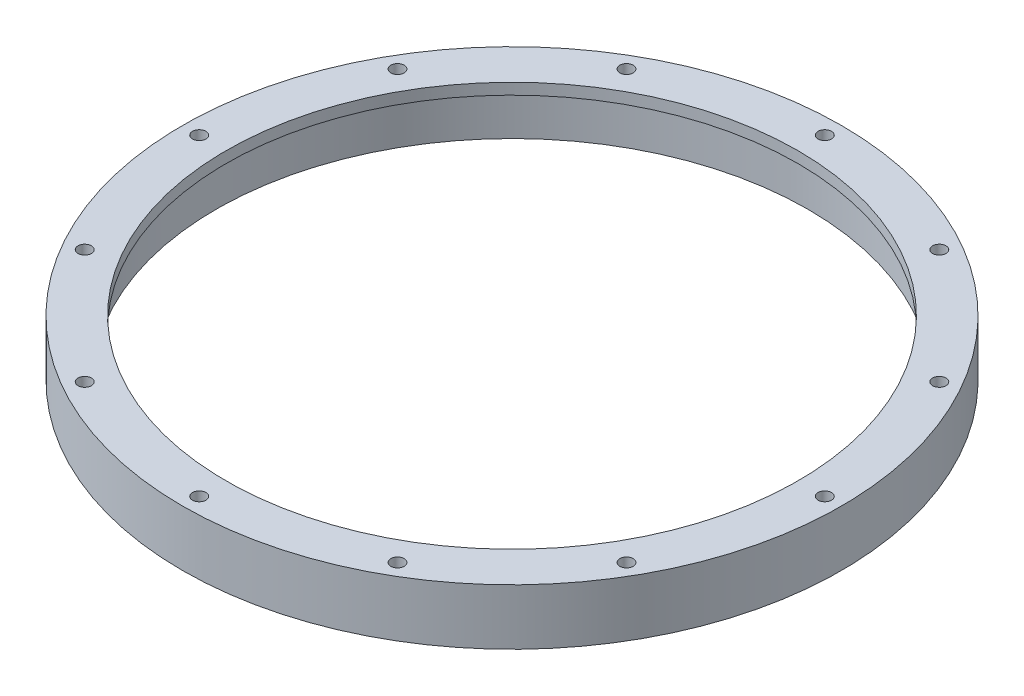
ISO-10303-21;
HEADER;
FILE_DESCRIPTION(('STEP AP214'),'2;1');
FILE_NAME('part.step','',(''),(''),'','','');
FILE_SCHEMA(('AUTOMOTIVE_DESIGN { 1 0 10303 214 1 1 1 1 }'));
ENDSEC;
DATA;
#1=APPLICATION_CONTEXT('core data for automotive mechanical design processes');
#2=APPLICATION_PROTOCOL_DEFINITION('international standard','automotive_design',2000,#1);
#3=PRODUCT_CONTEXT('',#1,'mechanical');
#4=PRODUCT('Part','Part','',(#3));
#5=PRODUCT_RELATED_PRODUCT_CATEGORY('part','',(#4));
#6=PRODUCT_DEFINITION_FORMATION('','',#4);
#7=PRODUCT_DEFINITION_CONTEXT('part definition',#1,'design');
#8=PRODUCT_DEFINITION('design','',#6,#7);
#9=PRODUCT_DEFINITION_SHAPE('','',#8);
#10=(LENGTH_UNIT() NAMED_UNIT(*) SI_UNIT(.MILLI.,.METRE.));
#11=(NAMED_UNIT(*) PLANE_ANGLE_UNIT() SI_UNIT($,.RADIAN.));
#12=(NAMED_UNIT(*) SI_UNIT($,.STERADIAN.) SOLID_ANGLE_UNIT());
#13=UNCERTAINTY_MEASURE_WITH_UNIT(LENGTH_MEASURE(1.E-05),#10,'distance_accuracy_value','');
#14=(GEOMETRIC_REPRESENTATION_CONTEXT(3) GLOBAL_UNCERTAINTY_ASSIGNED_CONTEXT((#13)) GLOBAL_UNIT_ASSIGNED_CONTEXT((#10,
#11,#12)) REPRESENTATION_CONTEXT('',''));
#15=CARTESIAN_POINT('',(0.,0.,0.));
#16=DIRECTION('',(0.,0.,1.));
#17=DIRECTION('',(1.,0.,0.));
#18=AXIS2_PLACEMENT_3D('',#15,#16,#17);
#19=CARTESIAN_POINT('',(0.,0.,0.));
#20=DIRECTION('',(0.,-1.,0.));
#21=DIRECTION('',(0.,0.,-1.));
#22=AXIS2_PLACEMENT_3D('',#19,#20,#21);
#23=CYLINDRICAL_SURFACE('',#22,53.);
#24=CARTESIAN_POINT('',(0.,8.,0.));
#25=DIRECTION('',(0.,-1.,0.));
#26=DIRECTION('',(0.,0.,-1.));
#27=AXIS2_PLACEMENT_3D('',#24,#25,#26);
#28=CIRCLE('',#27,53.);
#29=CARTESIAN_POINT('',(0.,8.,-53.));
#30=VERTEX_POINT('',#29);
#31=EDGE_CURVE('E71',#30,#30,#28,.T.);
#32=ORIENTED_EDGE('',*,*,#31,.F.);
#33=EDGE_LOOP('',(#32));
#34=FACE_BOUND('',#33,.T.);
#35=CARTESIAN_POINT('',(0.,0.,0.));
#36=DIRECTION('',(0.,-1.,0.));
#37=DIRECTION('',(0.,0.,-1.));
#38=AXIS2_PLACEMENT_3D('',#35,#36,#37);
#39=CIRCLE('',#38,53.);
#40=CARTESIAN_POINT('',(0.,0.,-53.));
#41=VERTEX_POINT('',#40);
#42=EDGE_CURVE('E10',#41,#41,#39,.T.);
#43=ORIENTED_EDGE('',*,*,#42,.T.);
#44=EDGE_LOOP('',(#43));
#45=FACE_BOUND('',#44,.T.);
#46=ADVANCED_FACE('F40',(#34,#45),#23,.F.);
#47=CARTESIAN_POINT('',(-53.,0.,0.));
#48=DIRECTION('',(0.,1.,0.));
#49=DIRECTION('',(0.,0.,1.));
#50=AXIS2_PLACEMENT_3D('',#47,#48,#49);
#51=PLANE('',#50);
#52=CARTESIAN_POINT('',(-48.4974226119286,0.,27.9999999999999));
#53=DIRECTION('',(0.,-1.,0.));
#54=DIRECTION('',(0.86602540378444,0.,-0.499999999999998));
#55=AXIS2_PLACEMENT_3D('',#52,#53,#54);
#56=CIRCLE('',#55,1.2);
#57=CARTESIAN_POINT('',(-47.4581921273873,0.,27.3999999999999));
#58=VERTEX_POINT('',#57);
#59=EDGE_CURVE('E146',#58,#58,#56,.T.);
#60=ORIENTED_EDGE('',*,*,#59,.F.);
#61=EDGE_LOOP('',(#60));
#62=FACE_BOUND('',#61,.T.);
#63=CARTESIAN_POINT('',(-56.,0.,-1.95522954975215E-13));
#64=DIRECTION('',(0.,-1.,0.));
#65=DIRECTION('',(1.,0.,0.));
#66=AXIS2_PLACEMENT_3D('',#63,#64,#65);
#67=CIRCLE('',#66,1.2);
#68=CARTESIAN_POINT('',(-54.8,0.,-1.91333177368604E-13));
#69=VERTEX_POINT('',#68);
#70=EDGE_CURVE('E138',#69,#69,#67,.T.);
#71=ORIENTED_EDGE('',*,*,#70,.F.);
#72=EDGE_LOOP('',(#71));
#73=FACE_BOUND('',#72,.T.);
#74=CARTESIAN_POINT('',(-48.4974226119284,0.,-28.0000000000002));
#75=DIRECTION('',(0.,-1.,0.));
#76=DIRECTION('',(0.866025403784436,0.,0.500000000000004));
#77=AXIS2_PLACEMENT_3D('',#74,#75,#76);
#78=CIRCLE('',#77,1.2);
#79=CARTESIAN_POINT('',(-47.4581921273871,0.,-27.4000000000002));
#80=VERTEX_POINT('',#79);
#81=EDGE_CURVE('E130',#80,#80,#78,.T.);
#82=ORIENTED_EDGE('',*,*,#81,.F.);
#83=EDGE_LOOP('',(#82));
#84=FACE_BOUND('',#83,.T.);
#85=CARTESIAN_POINT('',(-27.9999999999997,0.,-48.4974226119287));
#86=DIRECTION('',(0.,-1.,0.));
#87=DIRECTION('',(0.499999999999995,0.,0.866025403784442));
#88=AXIS2_PLACEMENT_3D('',#85,#86,#87);
#89=CIRCLE('',#88,1.2);
#90=CARTESIAN_POINT('',(-27.3999999999997,0.,-47.4581921273874));
#91=VERTEX_POINT('',#90);
#92=EDGE_CURVE('E122',#91,#91,#89,.T.);
#93=ORIENTED_EDGE('',*,*,#92,.F.);
#94=EDGE_LOOP('',(#93));
#95=FACE_BOUND('',#94,.T.);
#96=CARTESIAN_POINT('',(0.,0.,-56.));
#97=DIRECTION('',(0.,-1.,0.));
#98=DIRECTION('',(0.,0.,1.));
#99=AXIS2_PLACEMENT_3D('',#96,#97,#98);
#100=CIRCLE('',#99,1.2);
#101=CARTESIAN_POINT('',(0.,0.,-54.8));
#102=VERTEX_POINT('',#101);
#103=EDGE_CURVE('E114',#102,#102,#100,.T.);
#104=ORIENTED_EDGE('',*,*,#103,.F.);
#105=EDGE_LOOP('',(#104));
#106=FACE_BOUND('',#105,.T.);
#107=CARTESIAN_POINT('',(28.0000000000004,0.,-48.4974226119283));
#108=DIRECTION('',(0.,-1.,0.));
#109=DIRECTION('',(-0.500000000000007,0.,0.866025403784435));
#110=AXIS2_PLACEMENT_3D('',#107,#108,#109);
#111=CIRCLE('',#110,1.2);
#112=CARTESIAN_POINT('',(27.4000000000004,0.,-47.458192127387));
#113=VERTEX_POINT('',#112);
#114=EDGE_CURVE('E106',#113,#113,#111,.T.);
#115=ORIENTED_EDGE('',*,*,#114,.F.);
#116=EDGE_LOOP('',(#115));
#117=FACE_BOUND('',#116,.T.);
#118=CARTESIAN_POINT('',(48.4974226119288,0.,-27.9999999999995));
#119=DIRECTION('',(0.,-1.,0.));
#120=DIRECTION('',(-0.866025403784443,0.,0.499999999999992));
#121=AXIS2_PLACEMENT_3D('',#118,#119,#120);
#122=CIRCLE('',#121,1.2);
#123=CARTESIAN_POINT('',(47.4581921273875,0.,-27.3999999999996));
#124=VERTEX_POINT('',#123);
#125=EDGE_CURVE('E99',#124,#124,#122,.T.);
#126=ORIENTED_EDGE('',*,*,#125,.F.);
#127=EDGE_LOOP('',(#126));
#128=FACE_BOUND('',#127,.T.);
#129=CARTESIAN_POINT('',(56.,0.,5.86568864925646E-13));
#130=DIRECTION('',(0.,-1.,0.));
#131=DIRECTION('',(-1.,0.,0.));
#132=AXIS2_PLACEMENT_3D('',#129,#130,#131);
#133=CIRCLE('',#132,1.2);
#134=CARTESIAN_POINT('',(54.8,0.,5.73999532105811E-13));
#135=VERTEX_POINT('',#134);
#136=EDGE_CURVE('E91',#135,#135,#133,.T.);
#137=ORIENTED_EDGE('',*,*,#136,.F.);
#138=EDGE_LOOP('',(#137));
#139=FACE_BOUND('',#138,.T.);
#140=CARTESIAN_POINT('',(48.4974226119282,0.,28.0000000000006));
#141=DIRECTION('',(0.,-1.,0.));
#142=DIRECTION('',(-0.866025403784433,0.,-0.50000000000001));
#143=AXIS2_PLACEMENT_3D('',#140,#141,#142);
#144=CIRCLE('',#143,1.2);
#145=CARTESIAN_POINT('',(47.4581921273869,0.,27.4000000000006));
#146=VERTEX_POINT('',#145);
#147=EDGE_CURVE('E160',#146,#146,#144,.T.);
#148=ORIENTED_EDGE('',*,*,#147,.F.);
#149=EDGE_LOOP('',(#148));
#150=FACE_BOUND('',#149,.T.);
#151=CARTESIAN_POINT('',(27.9999999999994,0.,48.4974226119289));
#152=DIRECTION('',(0.,-1.,0.));
#153=DIRECTION('',(-0.499999999999989,0.,-0.866025403784445));
#154=AXIS2_PLACEMENT_3D('',#151,#152,#153);
#155=CIRCLE('',#154,1.2);
#156=CARTESIAN_POINT('',(27.3999999999994,0.,47.4581921273876));
#157=VERTEX_POINT('',#156);
#158=EDGE_CURVE('E152',#157,#157,#155,.T.);
#159=ORIENTED_EDGE('',*,*,#158,.F.);
#160=EDGE_LOOP('',(#159));
#161=FACE_BOUND('',#160,.T.);
#162=CARTESIAN_POINT('',(-28.0000000000001,0.,48.4974226119285));
#163=DIRECTION('',(0.,-1.,0.));
#164=DIRECTION('',(0.500000000000001,0.,-0.866025403784438));
#165=AXIS2_PLACEMENT_3D('',#162,#163,#164);
#166=CIRCLE('',#165,1.2);
#167=CARTESIAN_POINT('',(-27.4000000000001,0.,47.4581921273872));
#168=VERTEX_POINT('',#167);
#169=EDGE_CURVE('E83',#168,#168,#166,.T.);
#170=ORIENTED_EDGE('',*,*,#169,.F.);
#171=EDGE_LOOP('',(#170));
#172=FACE_BOUND('',#171,.T.);
#173=CARTESIAN_POINT('',(0.,0.,56.));
#174=DIRECTION('',(0.,-1.,0.));
#175=DIRECTION('',(0.,0.,-1.));
#176=AXIS2_PLACEMENT_3D('',#173,#174,#175);
#177=CIRCLE('',#176,1.2);
#178=CARTESIAN_POINT('',(0.,0.,54.8));
#179=VERTEX_POINT('',#178);
#180=EDGE_CURVE('E76',#179,#179,#177,.T.);
#181=ORIENTED_EDGE('',*,*,#180,.F.);
#182=EDGE_LOOP('',(#181));
#183=FACE_BOUND('',#182,.T.);
#184=ORIENTED_EDGE('',*,*,#42,.F.);
#185=EDGE_LOOP('',(#184));
#186=FACE_BOUND('',#185,.T.);
#187=CARTESIAN_POINT('',(0.,0.,0.));
#188=DIRECTION('',(0.,-1.,0.));
#189=DIRECTION('',(0.,0.,-1.));
#190=AXIS2_PLACEMENT_3D('',#187,#188,#189);
#191=CIRCLE('',#190,59.);
#192=CARTESIAN_POINT('',(0.,0.,-59.));
#193=VERTEX_POINT('',#192);
#194=EDGE_CURVE('E47',#193,#193,#191,.T.);
#195=ORIENTED_EDGE('',*,*,#194,.T.);
#196=EDGE_LOOP('',(#195));
#197=FACE_BOUND('',#196,.T.);
#198=ADVANCED_FACE('F179',(#62,#73,#84,#95,#106,#117,#128,#139,#150,#161,#172,#183,#186,#197),
#51,.F.);
#199=CARTESIAN_POINT('',(0.,0.,0.));
#200=DIRECTION('',(0.,-1.,0.));
#201=DIRECTION('',(0.,0.,-1.));
#202=AXIS2_PLACEMENT_3D('',#199,#200,#201);
#203=CYLINDRICAL_SURFACE('',#202,59.);
#204=ORIENTED_EDGE('',*,*,#194,.F.);
#205=EDGE_LOOP('',(#204));
#206=FACE_BOUND('',#205,.T.);
#207=CARTESIAN_POINT('',(0.,10.,0.));
#208=DIRECTION('',(0.,-1.,0.));
#209=DIRECTION('',(0.,0.,-1.));
#210=AXIS2_PLACEMENT_3D('',#207,#208,#209);
#211=CIRCLE('',#210,59.);
#212=CARTESIAN_POINT('',(0.,10.,-59.));
#213=VERTEX_POINT('',#212);
#214=EDGE_CURVE('E54',#213,#213,#211,.T.);
#215=ORIENTED_EDGE('',*,*,#214,.T.);
#216=EDGE_LOOP('',(#215));
#217=FACE_BOUND('',#216,.T.);
#218=ADVANCED_FACE('F182',(#206,#217),#203,.T.);
#219=CARTESIAN_POINT('',(-59.,10.,0.));
#220=DIRECTION('',(0.,-1.,0.));
#221=DIRECTION('',(0.,0.,-1.));
#222=AXIS2_PLACEMENT_3D('',#219,#220,#221);
#223=PLANE('',#222);
#224=CARTESIAN_POINT('',(-48.4974226119286,10.,27.9999999999999));
#225=DIRECTION('',(0.,-1.,0.));
#226=DIRECTION('',(0.86602540378444,0.,-0.499999999999998));
#227=AXIS2_PLACEMENT_3D('',#224,#225,#226);
#228=CIRCLE('',#227,1.2);
#229=CARTESIAN_POINT('',(-47.4581921273873,10.,27.3999999999999));
#230=VERTEX_POINT('',#229);
#231=EDGE_CURVE('E87',#230,#230,#228,.T.);
#232=ORIENTED_EDGE('',*,*,#231,.T.);
#233=EDGE_LOOP('',(#232));
#234=FACE_BOUND('',#233,.T.);
#235=CARTESIAN_POINT('',(-56.,10.,-1.95522954975215E-13));
#236=DIRECTION('',(0.,-1.,0.));
#237=DIRECTION('',(1.,0.,0.));
#238=AXIS2_PLACEMENT_3D('',#235,#236,#237);
#239=CIRCLE('',#238,1.2);
#240=CARTESIAN_POINT('',(-54.8,10.,-1.91333177368604E-13));
#241=VERTEX_POINT('',#240);
#242=EDGE_CURVE('E142',#241,#241,#239,.T.);
#243=ORIENTED_EDGE('',*,*,#242,.T.);
#244=EDGE_LOOP('',(#243));
#245=FACE_BOUND('',#244,.T.);
#246=CARTESIAN_POINT('',(-48.4974226119284,10.,-28.0000000000002));
#247=DIRECTION('',(0.,-1.,0.));
#248=DIRECTION('',(0.866025403784436,0.,0.500000000000004));
#249=AXIS2_PLACEMENT_3D('',#246,#247,#248);
#250=CIRCLE('',#249,1.2);
#251=CARTESIAN_POINT('',(-47.4581921273871,10.,-27.4000000000002));
#252=VERTEX_POINT('',#251);
#253=EDGE_CURVE('E134',#252,#252,#250,.T.);
#254=ORIENTED_EDGE('',*,*,#253,.T.);
#255=EDGE_LOOP('',(#254));
#256=FACE_BOUND('',#255,.T.);
#257=CARTESIAN_POINT('',(-27.9999999999997,10.,-48.4974226119287));
#258=DIRECTION('',(0.,-1.,0.));
#259=DIRECTION('',(0.499999999999995,0.,0.866025403784442));
#260=AXIS2_PLACEMENT_3D('',#257,#258,#259);
#261=CIRCLE('',#260,1.2);
#262=CARTESIAN_POINT('',(-27.3999999999997,10.,-47.4581921273874));
#263=VERTEX_POINT('',#262);
#264=EDGE_CURVE('E126',#263,#263,#261,.T.);
#265=ORIENTED_EDGE('',*,*,#264,.T.);
#266=EDGE_LOOP('',(#265));
#267=FACE_BOUND('',#266,.T.);
#268=CARTESIAN_POINT('',(0.,10.,-56.));
#269=DIRECTION('',(0.,-1.,0.));
#270=DIRECTION('',(0.,0.,1.));
#271=AXIS2_PLACEMENT_3D('',#268,#269,#270);
#272=CIRCLE('',#271,1.2);
#273=CARTESIAN_POINT('',(0.,10.,-54.8));
#274=VERTEX_POINT('',#273);
#275=EDGE_CURVE('E118',#274,#274,#272,.T.);
#276=ORIENTED_EDGE('',*,*,#275,.T.);
#277=EDGE_LOOP('',(#276));
#278=FACE_BOUND('',#277,.T.);
#279=CARTESIAN_POINT('',(28.0000000000004,10.,-48.4974226119283));
#280=DIRECTION('',(0.,-1.,0.));
#281=DIRECTION('',(-0.500000000000007,0.,0.866025403784435));
#282=AXIS2_PLACEMENT_3D('',#279,#280,#281);
#283=CIRCLE('',#282,1.2);
#284=CARTESIAN_POINT('',(27.4000000000004,10.,-47.458192127387));
#285=VERTEX_POINT('',#284);
#286=EDGE_CURVE('E110',#285,#285,#283,.T.);
#287=ORIENTED_EDGE('',*,*,#286,.T.);
#288=EDGE_LOOP('',(#287));
#289=FACE_BOUND('',#288,.T.);
#290=CARTESIAN_POINT('',(48.4974226119288,10.,-27.9999999999995));
#291=DIRECTION('',(0.,-1.,0.));
#292=DIRECTION('',(-0.866025403784443,0.,0.499999999999992));
#293=AXIS2_PLACEMENT_3D('',#290,#291,#292);
#294=CIRCLE('',#293,1.2);
#295=CARTESIAN_POINT('',(47.4581921273875,10.,-27.3999999999996));
#296=VERTEX_POINT('',#295);
#297=EDGE_CURVE('E102',#296,#296,#294,.T.);
#298=ORIENTED_EDGE('',*,*,#297,.T.);
#299=EDGE_LOOP('',(#298));
#300=FACE_BOUND('',#299,.T.);
#301=CARTESIAN_POINT('',(56.,10.,5.86568864925646E-13));
#302=DIRECTION('',(0.,-1.,0.));
#303=DIRECTION('',(-1.,0.,0.));
#304=AXIS2_PLACEMENT_3D('',#301,#302,#303);
#305=CIRCLE('',#304,1.2);
#306=CARTESIAN_POINT('',(54.8,10.,5.73999532105811E-13));
#307=VERTEX_POINT('',#306);
#308=EDGE_CURVE('E95',#307,#307,#305,.T.);
#309=ORIENTED_EDGE('',*,*,#308,.T.);
#310=EDGE_LOOP('',(#309));
#311=FACE_BOUND('',#310,.T.);
#312=CARTESIAN_POINT('',(48.4974226119282,10.,28.0000000000006));
#313=DIRECTION('',(0.,-1.,0.));
#314=DIRECTION('',(-0.866025403784433,0.,-0.50000000000001));
#315=AXIS2_PLACEMENT_3D('',#312,#313,#314);
#316=CIRCLE('',#315,1.2);
#317=CARTESIAN_POINT('',(47.4581921273869,10.,27.4000000000006));
#318=VERTEX_POINT('',#317);
#319=EDGE_CURVE('E96',#318,#318,#316,.T.);
#320=ORIENTED_EDGE('',*,*,#319,.T.);
#321=EDGE_LOOP('',(#320));
#322=FACE_BOUND('',#321,.T.);
#323=CARTESIAN_POINT('',(27.9999999999994,10.,48.4974226119289));
#324=DIRECTION('',(0.,-1.,0.));
#325=DIRECTION('',(-0.499999999999989,0.,-0.866025403784445));
#326=AXIS2_PLACEMENT_3D('',#323,#324,#325);
#327=CIRCLE('',#326,1.2);
#328=CARTESIAN_POINT('',(27.3999999999994,10.,47.4581921273876));
#329=VERTEX_POINT('',#328);
#330=EDGE_CURVE('E156',#329,#329,#327,.T.);
#331=ORIENTED_EDGE('',*,*,#330,.T.);
#332=EDGE_LOOP('',(#331));
#333=FACE_BOUND('',#332,.T.);
#334=CARTESIAN_POINT('',(-28.0000000000001,10.,48.4974226119285));
#335=DIRECTION('',(0.,-1.,0.));
#336=DIRECTION('',(0.500000000000001,0.,-0.866025403784438));
#337=AXIS2_PLACEMENT_3D('',#334,#335,#336);
#338=CIRCLE('',#337,1.2);
#339=CARTESIAN_POINT('',(-27.4000000000001,10.,47.4581921273872));
#340=VERTEX_POINT('',#339);
#341=EDGE_CURVE('E80',#340,#340,#338,.T.);
#342=ORIENTED_EDGE('',*,*,#341,.T.);
#343=EDGE_LOOP('',(#342));
#344=FACE_BOUND('',#343,.T.);
#345=CARTESIAN_POINT('',(0.,10.,56.));
#346=DIRECTION('',(0.,-1.,0.));
#347=DIRECTION('',(0.,0.,-1.));
#348=AXIS2_PLACEMENT_3D('',#345,#346,#347);
#349=CIRCLE('',#348,1.2);
#350=CARTESIAN_POINT('',(0.,10.,54.8));
#351=VERTEX_POINT('',#350);
#352=EDGE_CURVE('E75',#351,#351,#349,.T.);
#353=ORIENTED_EDGE('',*,*,#352,.T.);
#354=EDGE_LOOP('',(#353));
#355=FACE_BOUND('',#354,.T.);
#356=ORIENTED_EDGE('',*,*,#214,.F.);
#357=EDGE_LOOP('',(#356));
#358=FACE_BOUND('',#357,.T.);
#359=CARTESIAN_POINT('',(0.,10.,0.));
#360=DIRECTION('',(0.,-1.,0.));
#361=DIRECTION('',(0.,0.,-1.));
#362=AXIS2_PLACEMENT_3D('',#359,#360,#361);
#363=CIRCLE('',#362,51.2);
#364=CARTESIAN_POINT('',(0.,10.,-51.2));
#365=VERTEX_POINT('',#364);
#366=EDGE_CURVE('E61',#365,#365,#363,.T.);
#367=ORIENTED_EDGE('',*,*,#366,.T.);
#368=EDGE_LOOP('',(#367));
#369=FACE_BOUND('',#368,.T.);
#370=ADVANCED_FACE('F168',(#234,#245,#256,#267,#278,#289,#300,#311,#322,#333,#344,#355,#358,
#369),#223,.F.);
#371=CARTESIAN_POINT('',(0.,0.,0.));
#372=DIRECTION('',(0.,-1.,0.));
#373=DIRECTION('',(0.,0.,-1.));
#374=AXIS2_PLACEMENT_3D('',#371,#372,#373);
#375=CYLINDRICAL_SURFACE('',#374,51.2);
#376=ORIENTED_EDGE('',*,*,#366,.F.);
#377=EDGE_LOOP('',(#376));
#378=FACE_BOUND('',#377,.T.);
#379=CARTESIAN_POINT('',(0.,8.,0.));
#380=DIRECTION('',(0.,-1.,0.));
#381=DIRECTION('',(0.,0.,-1.));
#382=AXIS2_PLACEMENT_3D('',#379,#380,#381);
#383=CIRCLE('',#382,51.2);
#384=CARTESIAN_POINT('',(0.,8.,-51.2));
#385=VERTEX_POINT('',#384);
#386=EDGE_CURVE('E67',#385,#385,#383,.T.);
#387=ORIENTED_EDGE('',*,*,#386,.T.);
#388=EDGE_LOOP('',(#387));
#389=FACE_BOUND('',#388,.T.);
#390=ADVANCED_FACE('F203',(#378,#389),#375,.F.);
#391=CARTESIAN_POINT('',(-51.2,8.,0.));
#392=DIRECTION('',(0.,1.,0.));
#393=DIRECTION('',(0.,0.,1.));
#394=AXIS2_PLACEMENT_3D('',#391,#392,#393);
#395=PLANE('',#394);
#396=ORIENTED_EDGE('',*,*,#386,.F.);
#397=EDGE_LOOP('',(#396));
#398=FACE_BOUND('',#397,.T.);
#399=ORIENTED_EDGE('',*,*,#31,.T.);
#400=EDGE_LOOP('',(#399));
#401=FACE_BOUND('',#400,.T.);
#402=ADVANCED_FACE('F194',(#398,#401),#395,.F.);
#403=CARTESIAN_POINT('',(0.,10.,56.));
#404=DIRECTION('',(0.,-1.,0.));
#405=DIRECTION('',(0.,0.,-1.));
#406=AXIS2_PLACEMENT_3D('',#403,#404,#405);
#407=CYLINDRICAL_SURFACE('',#406,1.2);
#408=ORIENTED_EDGE('',*,*,#352,.F.);
#409=EDGE_LOOP('',(#408));
#410=FACE_BOUND('',#409,.T.);
#411=ORIENTED_EDGE('',*,*,#180,.T.);
#412=EDGE_LOOP('',(#411));
#413=FACE_BOUND('',#412,.T.);
#414=ADVANCED_FACE('F191',(#410,#413),#407,.F.);
#415=CARTESIAN_POINT('',(-28.0000000000001,10.,48.4974226119285));
#416=DIRECTION('',(0.,-1.,0.));
#417=DIRECTION('',(0.,0.,-1.));
#418=AXIS2_PLACEMENT_3D('',#415,#416,#417);
#419=CYLINDRICAL_SURFACE('',#418,1.2);
#420=ORIENTED_EDGE('',*,*,#341,.F.);
#421=EDGE_LOOP('',(#420));
#422=FACE_BOUND('',#421,.T.);
#423=ORIENTED_EDGE('',*,*,#169,.T.);
#424=EDGE_LOOP('',(#423));
#425=FACE_BOUND('',#424,.T.);
#426=ADVANCED_FACE('F193',(#422,#425),#419,.F.);
#427=CARTESIAN_POINT('',(27.9999999999994,10.,48.4974226119289));
#428=DIRECTION('',(0.,-1.,0.));
#429=DIRECTION('',(0.,0.,-1.));
#430=AXIS2_PLACEMENT_3D('',#427,#428,#429);
#431=CYLINDRICAL_SURFACE('',#430,1.2);
#432=ORIENTED_EDGE('',*,*,#330,.F.);
#433=EDGE_LOOP('',(#432));
#434=FACE_BOUND('',#433,.T.);
#435=ORIENTED_EDGE('',*,*,#158,.T.);
#436=EDGE_LOOP('',(#435));
#437=FACE_BOUND('',#436,.T.);
#438=ADVANCED_FACE('F175',(#434,#437),#431,.F.);
#439=CARTESIAN_POINT('',(48.4974226119282,10.,28.0000000000006));
#440=DIRECTION('',(0.,-1.,0.));
#441=DIRECTION('',(0.,0.,-1.));
#442=AXIS2_PLACEMENT_3D('',#439,#440,#441);
#443=CYLINDRICAL_SURFACE('',#442,1.2);
#444=ORIENTED_EDGE('',*,*,#319,.F.);
#445=EDGE_LOOP('',(#444));
#446=FACE_BOUND('',#445,.T.);
#447=ORIENTED_EDGE('',*,*,#147,.T.);
#448=EDGE_LOOP('',(#447));
#449=FACE_BOUND('',#448,.T.);
#450=ADVANCED_FACE('F171',(#446,#449),#443,.F.);
#451=CARTESIAN_POINT('',(56.,10.,5.86568864925646E-13));
#452=DIRECTION('',(0.,-1.,0.));
#453=DIRECTION('',(0.,0.,-1.));
#454=AXIS2_PLACEMENT_3D('',#451,#452,#453);
#455=CYLINDRICAL_SURFACE('',#454,1.2);
#456=ORIENTED_EDGE('',*,*,#308,.F.);
#457=EDGE_LOOP('',(#456));
#458=FACE_BOUND('',#457,.T.);
#459=ORIENTED_EDGE('',*,*,#136,.T.);
#460=EDGE_LOOP('',(#459));
#461=FACE_BOUND('',#460,.T.);
#462=ADVANCED_FACE('F174',(#458,#461),#455,.F.);
#463=CARTESIAN_POINT('',(48.4974226119288,10.,-27.9999999999995));
#464=DIRECTION('',(0.,-1.,0.));
#465=DIRECTION('',(0.,0.,-1.));
#466=AXIS2_PLACEMENT_3D('',#463,#464,#465);
#467=CYLINDRICAL_SURFACE('',#466,1.2);
#468=ORIENTED_EDGE('',*,*,#297,.F.);
#469=EDGE_LOOP('',(#468));
#470=FACE_BOUND('',#469,.T.);
#471=ORIENTED_EDGE('',*,*,#125,.T.);
#472=EDGE_LOOP('',(#471));
#473=FACE_BOUND('',#472,.T.);
#474=ADVANCED_FACE('F267',(#470,#473),#467,.F.);
#475=CARTESIAN_POINT('',(28.0000000000004,10.,-48.4974226119283));
#476=DIRECTION('',(0.,-1.,0.));
#477=DIRECTION('',(0.,0.,-1.));
#478=AXIS2_PLACEMENT_3D('',#475,#476,#477);
#479=CYLINDRICAL_SURFACE('',#478,1.2);
#480=ORIENTED_EDGE('',*,*,#286,.F.);
#481=EDGE_LOOP('',(#480));
#482=FACE_BOUND('',#481,.T.);
#483=ORIENTED_EDGE('',*,*,#114,.T.);
#484=EDGE_LOOP('',(#483));
#485=FACE_BOUND('',#484,.T.);
#486=ADVANCED_FACE('F275',(#482,#485),#479,.F.);
#487=CARTESIAN_POINT('',(0.,10.,-56.));
#488=DIRECTION('',(0.,-1.,0.));
#489=DIRECTION('',(0.,0.,-1.));
#490=AXIS2_PLACEMENT_3D('',#487,#488,#489);
#491=CYLINDRICAL_SURFACE('',#490,1.2);
#492=ORIENTED_EDGE('',*,*,#275,.F.);
#493=EDGE_LOOP('',(#492));
#494=FACE_BOUND('',#493,.T.);
#495=ORIENTED_EDGE('',*,*,#103,.T.);
#496=EDGE_LOOP('',(#495));
#497=FACE_BOUND('',#496,.T.);
#498=ADVANCED_FACE('F283',(#494,#497),#491,.F.);
#499=CARTESIAN_POINT('',(-27.9999999999997,10.,-48.4974226119287));
#500=DIRECTION('',(0.,-1.,0.));
#501=DIRECTION('',(0.,0.,-1.));
#502=AXIS2_PLACEMENT_3D('',#499,#500,#501);
#503=CYLINDRICAL_SURFACE('',#502,1.2);
#504=ORIENTED_EDGE('',*,*,#264,.F.);
#505=EDGE_LOOP('',(#504));
#506=FACE_BOUND('',#505,.T.);
#507=ORIENTED_EDGE('',*,*,#92,.T.);
#508=EDGE_LOOP('',(#507));
#509=FACE_BOUND('',#508,.T.);
#510=ADVANCED_FACE('F292',(#506,#509),#503,.F.);
#511=CARTESIAN_POINT('',(-48.4974226119284,10.,-28.0000000000002));
#512=DIRECTION('',(0.,-1.,0.));
#513=DIRECTION('',(0.,0.,-1.));
#514=AXIS2_PLACEMENT_3D('',#511,#512,#513);
#515=CYLINDRICAL_SURFACE('',#514,1.2);
#516=ORIENTED_EDGE('',*,*,#253,.F.);
#517=EDGE_LOOP('',(#516));
#518=FACE_BOUND('',#517,.T.);
#519=ORIENTED_EDGE('',*,*,#81,.T.);
#520=EDGE_LOOP('',(#519));
#521=FACE_BOUND('',#520,.T.);
#522=ADVANCED_FACE('F301',(#518,#521),#515,.F.);
#523=CARTESIAN_POINT('',(-56.,10.,-1.95522954975215E-13));
#524=DIRECTION('',(0.,-1.,0.));
#525=DIRECTION('',(0.,0.,-1.));
#526=AXIS2_PLACEMENT_3D('',#523,#524,#525);
#527=CYLINDRICAL_SURFACE('',#526,1.2);
#528=ORIENTED_EDGE('',*,*,#242,.F.);
#529=EDGE_LOOP('',(#528));
#530=FACE_BOUND('',#529,.T.);
#531=ORIENTED_EDGE('',*,*,#70,.T.);
#532=EDGE_LOOP('',(#531));
#533=FACE_BOUND('',#532,.T.);
#534=ADVANCED_FACE('F310',(#530,#533),#527,.F.);
#535=CARTESIAN_POINT('',(-48.4974226119286,10.,27.9999999999999));
#536=DIRECTION('',(0.,-1.,0.));
#537=DIRECTION('',(0.,0.,-1.));
#538=AXIS2_PLACEMENT_3D('',#535,#536,#537);
#539=CYLINDRICAL_SURFACE('',#538,1.2);
#540=ORIENTED_EDGE('',*,*,#231,.F.);
#541=EDGE_LOOP('',(#540));
#542=FACE_BOUND('',#541,.T.);
#543=ORIENTED_EDGE('',*,*,#59,.T.);
#544=EDGE_LOOP('',(#543));
#545=FACE_BOUND('',#544,.T.);
#546=ADVANCED_FACE('F319',(#542,#545),#539,.F.);
#547=CLOSED_SHELL('',(#46,#198,#218,#370,#390,#402,#414,#426,#438,#450,#462,#474,#486,#498,#510,
#522,#534,#546));
#548=MANIFOLD_SOLID_BREP('B2',#547);
#549=ADVANCED_BREP_SHAPE_REPRESENTATION('',(#18,#548),#14);
#550=SHAPE_DEFINITION_REPRESENTATION(#9,#549);
ENDSEC;
END-ISO-10303-21;
